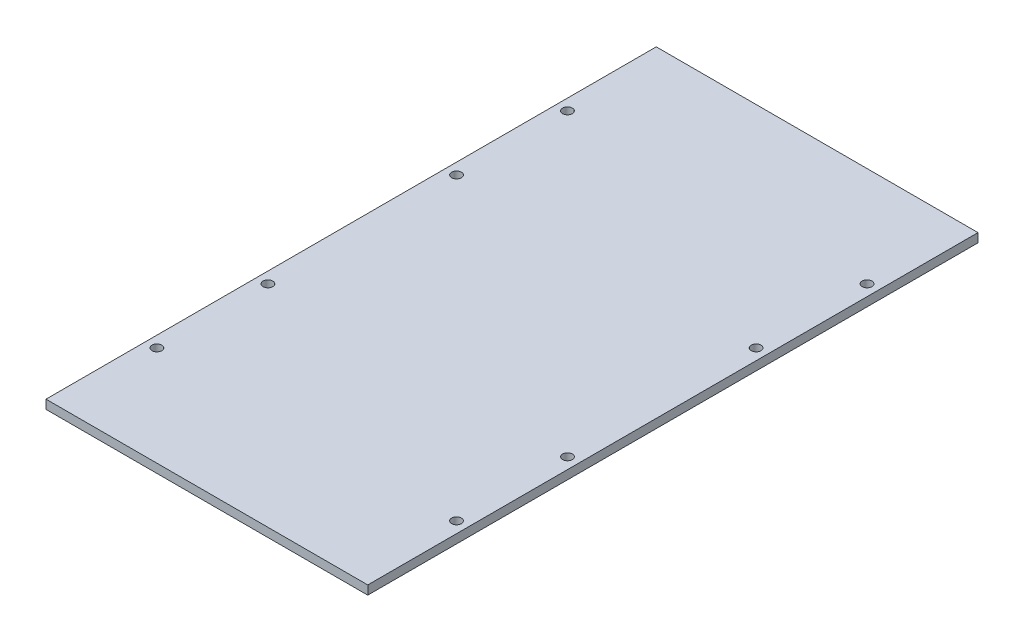
ISO-10303-21;
HEADER;
FILE_DESCRIPTION(('STEP AP214'),'2;1');
FILE_NAME('part.step','',(''),(''),'','','');
FILE_SCHEMA(('AUTOMOTIVE_DESIGN { 1 0 10303 214 1 1 1 1 }'));
ENDSEC;
DATA;
#1=APPLICATION_CONTEXT('core data for automotive mechanical design processes');
#2=APPLICATION_PROTOCOL_DEFINITION('international standard','automotive_design',2000,#1);
#3=PRODUCT_CONTEXT('',#1,'mechanical');
#4=PRODUCT('Part','Part','',(#3));
#5=PRODUCT_RELATED_PRODUCT_CATEGORY('part','',(#4));
#6=PRODUCT_DEFINITION_FORMATION('','',#4);
#7=PRODUCT_DEFINITION_CONTEXT('part definition',#1,'design');
#8=PRODUCT_DEFINITION('design','',#6,#7);
#9=PRODUCT_DEFINITION_SHAPE('','',#8);
#10=(LENGTH_UNIT() NAMED_UNIT(*) SI_UNIT(.MILLI.,.METRE.));
#11=(NAMED_UNIT(*) PLANE_ANGLE_UNIT() SI_UNIT($,.RADIAN.));
#12=(NAMED_UNIT(*) SI_UNIT($,.STERADIAN.) SOLID_ANGLE_UNIT());
#13=UNCERTAINTY_MEASURE_WITH_UNIT(LENGTH_MEASURE(1.E-05),#10,'distance_accuracy_value','');
#14=(GEOMETRIC_REPRESENTATION_CONTEXT(3) GLOBAL_UNCERTAINTY_ASSIGNED_CONTEXT((#13)) GLOBAL_UNIT_ASSIGNED_CONTEXT((#10,
#11,#12)) REPRESENTATION_CONTEXT('',''));
#15=CARTESIAN_POINT('',(0.,0.,0.));
#16=DIRECTION('',(0.,0.,1.));
#17=DIRECTION('',(1.,0.,0.));
#18=AXIS2_PLACEMENT_3D('',#15,#16,#17);
#19=CARTESIAN_POINT('',(-72.5000000000001,4.,137.5));
#20=DIRECTION('',(1.,0.,0.));
#21=DIRECTION('',(0.,0.,-1.));
#22=AXIS2_PLACEMENT_3D('',#19,#20,#21);
#23=PLANE('',#22);
#24=DIRECTION('',(0.,0.,1.));
#25=VECTOR('',#24,1.);
#26=CARTESIAN_POINT('',(-72.5000000000001,0.,137.5));
#27=LINE('',#26,#25);
#28=CARTESIAN_POINT('',(-72.5000000000001,0.,-137.5));
#29=VERTEX_POINT('',#28);
#30=CARTESIAN_POINT('',(-72.5000000000001,0.,137.5));
#31=VERTEX_POINT('',#30);
#32=EDGE_CURVE('E99',#29,#31,#27,.T.);
#33=ORIENTED_EDGE('',*,*,#32,.T.);
#34=DIRECTION('',(0.,-1.,0.));
#35=VECTOR('',#34,1.);
#36=CARTESIAN_POINT('',(-72.5000000000001,4.,137.5));
#37=LINE('',#36,#35);
#38=CARTESIAN_POINT('',(-72.5000000000001,4.,137.5));
#39=VERTEX_POINT('',#38);
#40=EDGE_CURVE('E11',#39,#31,#37,.T.);
#41=ORIENTED_EDGE('',*,*,#40,.F.);
#42=DIRECTION('',(0.,0.,1.));
#43=VECTOR('',#42,1.);
#44=CARTESIAN_POINT('',(-72.5000000000001,4.,137.5));
#45=LINE('',#44,#43);
#46=CARTESIAN_POINT('',(-72.5000000000001,4.,-137.5));
#47=VERTEX_POINT('',#46);
#48=EDGE_CURVE('E87',#47,#39,#45,.T.);
#49=ORIENTED_EDGE('',*,*,#48,.F.);
#50=DIRECTION('',(0.,-1.,0.));
#51=VECTOR('',#50,1.);
#52=CARTESIAN_POINT('',(-72.5000000000001,4.,-137.5));
#53=LINE('',#52,#51);
#54=EDGE_CURVE('E95',#47,#29,#53,.T.);
#55=ORIENTED_EDGE('',*,*,#54,.T.);
#56=EDGE_LOOP('',(#33,#41,#49,#55));
#57=FACE_BOUND('',#56,.T.);
#58=ADVANCED_FACE('F36',(#57),#23,.F.);
#59=CARTESIAN_POINT('',(72.5,4.,137.5));
#60=DIRECTION('',(0.,0.,-1.));
#61=DIRECTION('',(-1.,0.,0.));
#62=AXIS2_PLACEMENT_3D('',#59,#60,#61);
#63=PLANE('',#62);
#64=DIRECTION('',(1.,0.,0.));
#65=VECTOR('',#64,1.);
#66=CARTESIAN_POINT('',(72.5,0.,137.5));
#67=LINE('',#66,#65);
#68=CARTESIAN_POINT('',(72.5,0.,137.5));
#69=VERTEX_POINT('',#68);
#70=EDGE_CURVE('E91',#31,#69,#67,.T.);
#71=ORIENTED_EDGE('',*,*,#70,.T.);
#72=DIRECTION('',(0.,-1.,0.));
#73=VECTOR('',#72,1.);
#74=CARTESIAN_POINT('',(72.5,4.,137.5));
#75=LINE('',#74,#73);
#76=CARTESIAN_POINT('',(72.5,4.,137.5));
#77=VERTEX_POINT('',#76);
#78=EDGE_CURVE('E44',#77,#69,#75,.T.);
#79=ORIENTED_EDGE('',*,*,#78,.F.);
#80=DIRECTION('',(1.,0.,0.));
#81=VECTOR('',#80,1.);
#82=CARTESIAN_POINT('',(72.5,4.,137.5));
#83=LINE('',#82,#81);
#84=EDGE_CURVE('E82',#39,#77,#83,.T.);
#85=ORIENTED_EDGE('',*,*,#84,.F.);
#86=ORIENTED_EDGE('',*,*,#40,.T.);
#87=EDGE_LOOP('',(#71,#79,#85,#86));
#88=FACE_BOUND('',#87,.T.);
#89=ADVANCED_FACE('F90',(#88),#63,.F.);
#90=CARTESIAN_POINT('',(72.5,4.,137.5));
#91=DIRECTION('',(-1.,0.,0.));
#92=DIRECTION('',(0.,0.,1.));
#93=AXIS2_PLACEMENT_3D('',#90,#91,#92);
#94=PLANE('',#93);
#95=DIRECTION('',(0.,0.,-1.));
#96=VECTOR('',#95,1.);
#97=CARTESIAN_POINT('',(72.5,0.,137.5));
#98=LINE('',#97,#96);
#99=CARTESIAN_POINT('',(72.4999999999999,0.,-137.5));
#100=VERTEX_POINT('',#99);
#101=EDGE_CURVE('E69',#69,#100,#98,.T.);
#102=ORIENTED_EDGE('',*,*,#101,.T.);
#103=DIRECTION('',(0.,-1.,0.));
#104=VECTOR('',#103,1.);
#105=CARTESIAN_POINT('',(72.4999999999999,4.,-137.5));
#106=LINE('',#105,#104);
#107=CARTESIAN_POINT('',(72.4999999999999,4.,-137.5));
#108=VERTEX_POINT('',#107);
#109=EDGE_CURVE('E92',#108,#100,#106,.T.);
#110=ORIENTED_EDGE('',*,*,#109,.F.);
#111=DIRECTION('',(0.,0.,-1.));
#112=VECTOR('',#111,1.);
#113=CARTESIAN_POINT('',(72.5,4.,137.5));
#114=LINE('',#113,#112);
#115=EDGE_CURVE('E85',#77,#108,#114,.T.);
#116=ORIENTED_EDGE('',*,*,#115,.F.);
#117=ORIENTED_EDGE('',*,*,#78,.T.);
#118=EDGE_LOOP('',(#102,#110,#116,#117));
#119=FACE_BOUND('',#118,.T.);
#120=ADVANCED_FACE('F93',(#119),#94,.F.);
#121=CARTESIAN_POINT('',(72.4999999999999,4.,-137.5));
#122=DIRECTION('',(0.,0.,1.));
#123=DIRECTION('',(1.,0.,0.));
#124=AXIS2_PLACEMENT_3D('',#121,#122,#123);
#125=PLANE('',#124);
#126=DIRECTION('',(-1.,0.,0.));
#127=VECTOR('',#126,1.);
#128=CARTESIAN_POINT('',(72.4999999999999,0.,-137.5));
#129=LINE('',#128,#127);
#130=EDGE_CURVE('E75',#100,#29,#129,.T.);
#131=ORIENTED_EDGE('',*,*,#130,.T.);
#132=ORIENTED_EDGE('',*,*,#54,.F.);
#133=DIRECTION('',(-1.,0.,0.));
#134=VECTOR('',#133,1.);
#135=CARTESIAN_POINT('',(72.4999999999999,4.,-137.5));
#136=LINE('',#135,#134);
#137=EDGE_CURVE('E52',#108,#47,#136,.T.);
#138=ORIENTED_EDGE('',*,*,#137,.F.);
#139=ORIENTED_EDGE('',*,*,#109,.T.);
#140=EDGE_LOOP('',(#131,#132,#138,#139));
#141=FACE_BOUND('',#140,.T.);
#142=ADVANCED_FACE('F107',(#141),#125,.F.);
#143=CARTESIAN_POINT('',(0.,4.,0.));
#144=DIRECTION('',(0.,1.,0.));
#145=DIRECTION('',(0.,0.,1.));
#146=AXIS2_PLACEMENT_3D('',#143,#144,#145);
#147=PLANE('',#146);
#148=CARTESIAN_POINT('',(-67.5,4.,-42.5000000000001));
#149=DIRECTION('',(0.,1.,0.));
#150=DIRECTION('',(0.,0.,1.));
#151=AXIS2_PLACEMENT_3D('',#148,#149,#150);
#152=CIRCLE('',#151,2.2);
#153=CARTESIAN_POINT('',(-67.5,4.,-40.3000000000001));
#154=VERTEX_POINT('',#153);
#155=EDGE_CURVE('E138',#154,#154,#152,.T.);
#156=ORIENTED_EDGE('',*,*,#155,.F.);
#157=EDGE_LOOP('',(#156));
#158=FACE_BOUND('',#157,.T.);
#159=CARTESIAN_POINT('',(-67.5,4.,42.4999999999999));
#160=DIRECTION('',(0.,1.,0.));
#161=DIRECTION('',(0.,0.,1.));
#162=AXIS2_PLACEMENT_3D('',#159,#160,#161);
#163=CIRCLE('',#162,2.2);
#164=CARTESIAN_POINT('',(-67.5,4.,44.6999999999999));
#165=VERTEX_POINT('',#164);
#166=EDGE_CURVE('E132',#165,#165,#163,.T.);
#167=ORIENTED_EDGE('',*,*,#166,.F.);
#168=EDGE_LOOP('',(#167));
#169=FACE_BOUND('',#168,.T.);
#170=CARTESIAN_POINT('',(-67.5,4.,92.4999999999999));
#171=DIRECTION('',(0.,1.,0.));
#172=DIRECTION('',(0.,0.,1.));
#173=AXIS2_PLACEMENT_3D('',#170,#171,#172);
#174=CIRCLE('',#173,2.2);
#175=CARTESIAN_POINT('',(-67.5,4.,94.6999999999999));
#176=VERTEX_POINT('',#175);
#177=EDGE_CURVE('E126',#176,#176,#174,.T.);
#178=ORIENTED_EDGE('',*,*,#177,.F.);
#179=EDGE_LOOP('',(#178));
#180=FACE_BOUND('',#179,.T.);
#181=CARTESIAN_POINT('',(67.5,4.,92.4999999999999));
#182=DIRECTION('',(0.,1.,0.));
#183=DIRECTION('',(0.,0.,-1.));
#184=AXIS2_PLACEMENT_3D('',#181,#182,#183);
#185=CIRCLE('',#184,2.2);
#186=CARTESIAN_POINT('',(67.5,4.,90.3));
#187=VERTEX_POINT('',#186);
#188=EDGE_CURVE('E119',#187,#187,#185,.T.);
#189=ORIENTED_EDGE('',*,*,#188,.F.);
#190=EDGE_LOOP('',(#189));
#191=FACE_BOUND('',#190,.T.);
#192=CARTESIAN_POINT('',(67.5,4.,42.4999999999999));
#193=DIRECTION('',(0.,1.,0.));
#194=DIRECTION('',(0.,0.,-1.));
#195=AXIS2_PLACEMENT_3D('',#192,#193,#194);
#196=CIRCLE('',#195,2.2);
#197=CARTESIAN_POINT('',(67.5,4.,40.2999999999999));
#198=VERTEX_POINT('',#197);
#199=EDGE_CURVE('E155',#198,#198,#196,.T.);
#200=ORIENTED_EDGE('',*,*,#199,.F.);
#201=EDGE_LOOP('',(#200));
#202=FACE_BOUND('',#201,.T.);
#203=CARTESIAN_POINT('',(67.5,4.,-42.5000000000001));
#204=DIRECTION('',(0.,1.,0.));
#205=DIRECTION('',(0.,0.,-1.));
#206=AXIS2_PLACEMENT_3D('',#203,#204,#205);
#207=CIRCLE('',#206,2.2);
#208=CARTESIAN_POINT('',(67.5,4.,-44.7000000000001));
#209=VERTEX_POINT('',#208);
#210=EDGE_CURVE('E149',#209,#209,#207,.T.);
#211=ORIENTED_EDGE('',*,*,#210,.F.);
#212=EDGE_LOOP('',(#211));
#213=FACE_BOUND('',#212,.T.);
#214=CARTESIAN_POINT('',(67.5,4.,-92.5000000000001));
#215=DIRECTION('',(0.,1.,0.));
#216=DIRECTION('',(0.,0.,-1.));
#217=AXIS2_PLACEMENT_3D('',#214,#215,#216);
#218=CIRCLE('',#217,2.2);
#219=CARTESIAN_POINT('',(67.5,4.,-94.7000000000001));
#220=VERTEX_POINT('',#219);
#221=EDGE_CURVE('E143',#220,#220,#218,.T.);
#222=ORIENTED_EDGE('',*,*,#221,.F.);
#223=EDGE_LOOP('',(#222));
#224=FACE_BOUND('',#223,.T.);
#225=CARTESIAN_POINT('',(-67.5,4.,-92.5000000000001));
#226=DIRECTION('',(0.,1.,0.));
#227=DIRECTION('',(0.,0.,1.));
#228=AXIS2_PLACEMENT_3D('',#225,#226,#227);
#229=CIRCLE('',#228,2.2);
#230=CARTESIAN_POINT('',(-67.5,4.,-90.3000000000001));
#231=VERTEX_POINT('',#230);
#232=EDGE_CURVE('E113',#231,#231,#229,.T.);
#233=ORIENTED_EDGE('',*,*,#232,.F.);
#234=EDGE_LOOP('',(#233));
#235=FACE_BOUND('',#234,.T.);
#236=ORIENTED_EDGE('',*,*,#48,.T.);
#237=ORIENTED_EDGE('',*,*,#84,.T.);
#238=ORIENTED_EDGE('',*,*,#115,.T.);
#239=ORIENTED_EDGE('',*,*,#137,.T.);
#240=EDGE_LOOP('',(#236,#237,#238,#239));
#241=FACE_BOUND('',#240,.T.);
#242=ADVANCED_FACE('F83',(#158,#169,#180,#191,#202,#213,#224,#235,#241),#147,.T.);
#243=CARTESIAN_POINT('',(0.,0.,0.));
#244=DIRECTION('',(0.,1.,0.));
#245=DIRECTION('',(0.,0.,1.));
#246=AXIS2_PLACEMENT_3D('',#243,#244,#245);
#247=PLANE('',#246);
#248=CARTESIAN_POINT('',(-67.5,0.,-42.5000000000001));
#249=DIRECTION('',(0.,1.,0.));
#250=DIRECTION('',(0.,0.,1.));
#251=AXIS2_PLACEMENT_3D('',#248,#249,#250);
#252=CIRCLE('',#251,2.2);
#253=CARTESIAN_POINT('',(-67.5,0.,-40.3000000000001));
#254=VERTEX_POINT('',#253);
#255=EDGE_CURVE('E116',#254,#254,#252,.T.);
#256=ORIENTED_EDGE('',*,*,#255,.T.);
#257=EDGE_LOOP('',(#256));
#258=FACE_BOUND('',#257,.T.);
#259=CARTESIAN_POINT('',(-67.5,0.,42.4999999999999));
#260=DIRECTION('',(0.,1.,0.));
#261=DIRECTION('',(0.,0.,1.));
#262=AXIS2_PLACEMENT_3D('',#259,#260,#261);
#263=CIRCLE('',#262,2.2);
#264=CARTESIAN_POINT('',(-67.5,0.,44.6999999999999));
#265=VERTEX_POINT('',#264);
#266=EDGE_CURVE('E135',#265,#265,#263,.T.);
#267=ORIENTED_EDGE('',*,*,#266,.T.);
#268=EDGE_LOOP('',(#267));
#269=FACE_BOUND('',#268,.T.);
#270=CARTESIAN_POINT('',(-67.5,0.,92.4999999999999));
#271=DIRECTION('',(0.,1.,0.));
#272=DIRECTION('',(0.,0.,1.));
#273=AXIS2_PLACEMENT_3D('',#270,#271,#272);
#274=CIRCLE('',#273,2.2);
#275=CARTESIAN_POINT('',(-67.5,0.,94.6999999999999));
#276=VERTEX_POINT('',#275);
#277=EDGE_CURVE('E129',#276,#276,#274,.T.);
#278=ORIENTED_EDGE('',*,*,#277,.T.);
#279=EDGE_LOOP('',(#278));
#280=FACE_BOUND('',#279,.T.);
#281=CARTESIAN_POINT('',(67.5,0.,92.4999999999999));
#282=DIRECTION('',(0.,1.,0.));
#283=DIRECTION('',(0.,0.,-1.));
#284=AXIS2_PLACEMENT_3D('',#281,#282,#283);
#285=CIRCLE('',#284,2.2);
#286=CARTESIAN_POINT('',(67.5,0.,90.3));
#287=VERTEX_POINT('',#286);
#288=EDGE_CURVE('E122',#287,#287,#285,.T.);
#289=ORIENTED_EDGE('',*,*,#288,.T.);
#290=EDGE_LOOP('',(#289));
#291=FACE_BOUND('',#290,.T.);
#292=CARTESIAN_POINT('',(67.5,0.,42.4999999999999));
#293=DIRECTION('',(0.,1.,0.));
#294=DIRECTION('',(0.,0.,-1.));
#295=AXIS2_PLACEMENT_3D('',#292,#293,#294);
#296=CIRCLE('',#295,2.2);
#297=CARTESIAN_POINT('',(67.5,0.,40.2999999999999));
#298=VERTEX_POINT('',#297);
#299=EDGE_CURVE('E123',#298,#298,#296,.T.);
#300=ORIENTED_EDGE('',*,*,#299,.T.);
#301=EDGE_LOOP('',(#300));
#302=FACE_BOUND('',#301,.T.);
#303=CARTESIAN_POINT('',(67.5,0.,-42.5000000000001));
#304=DIRECTION('',(0.,1.,0.));
#305=DIRECTION('',(0.,0.,-1.));
#306=AXIS2_PLACEMENT_3D('',#303,#304,#305);
#307=CIRCLE('',#306,2.2);
#308=CARTESIAN_POINT('',(67.5,0.,-44.7000000000001));
#309=VERTEX_POINT('',#308);
#310=EDGE_CURVE('E152',#309,#309,#307,.T.);
#311=ORIENTED_EDGE('',*,*,#310,.T.);
#312=EDGE_LOOP('',(#311));
#313=FACE_BOUND('',#312,.T.);
#314=CARTESIAN_POINT('',(67.5,0.,-92.5000000000001));
#315=DIRECTION('',(0.,1.,0.));
#316=DIRECTION('',(0.,0.,-1.));
#317=AXIS2_PLACEMENT_3D('',#314,#315,#316);
#318=CIRCLE('',#317,2.2);
#319=CARTESIAN_POINT('',(67.5,0.,-94.7000000000001));
#320=VERTEX_POINT('',#319);
#321=EDGE_CURVE('E146',#320,#320,#318,.T.);
#322=ORIENTED_EDGE('',*,*,#321,.T.);
#323=EDGE_LOOP('',(#322));
#324=FACE_BOUND('',#323,.T.);
#325=CARTESIAN_POINT('',(-67.5,0.,-92.5000000000001));
#326=DIRECTION('',(0.,1.,0.));
#327=DIRECTION('',(0.,0.,1.));
#328=AXIS2_PLACEMENT_3D('',#325,#326,#327);
#329=CIRCLE('',#328,2.2);
#330=CARTESIAN_POINT('',(-67.5,0.,-90.3000000000001));
#331=VERTEX_POINT('',#330);
#332=EDGE_CURVE('E102',#331,#331,#329,.T.);
#333=ORIENTED_EDGE('',*,*,#332,.T.);
#334=EDGE_LOOP('',(#333));
#335=FACE_BOUND('',#334,.T.);
#336=ORIENTED_EDGE('',*,*,#32,.F.);
#337=ORIENTED_EDGE('',*,*,#130,.F.);
#338=ORIENTED_EDGE('',*,*,#101,.F.);
#339=ORIENTED_EDGE('',*,*,#70,.F.);
#340=EDGE_LOOP('',(#336,#337,#338,#339));
#341=FACE_BOUND('',#340,.T.);
#342=ADVANCED_FACE('F110',(#258,#269,#280,#291,#302,#313,#324,#335,#341),#247,.F.);
#343=CARTESIAN_POINT('',(-67.5,0.,-92.5000000000001));
#344=DIRECTION('',(0.,1.,0.));
#345=DIRECTION('',(0.,0.,1.));
#346=AXIS2_PLACEMENT_3D('',#343,#344,#345);
#347=CYLINDRICAL_SURFACE('',#346,2.2);
#348=ORIENTED_EDGE('',*,*,#332,.F.);
#349=EDGE_LOOP('',(#348));
#350=FACE_BOUND('',#349,.T.);
#351=ORIENTED_EDGE('',*,*,#232,.T.);
#352=EDGE_LOOP('',(#351));
#353=FACE_BOUND('',#352,.T.);
#354=ADVANCED_FACE('F181',(#350,#353),#347,.F.);
#355=CARTESIAN_POINT('',(67.5,0.,-92.5000000000001));
#356=DIRECTION('',(0.,1.,0.));
#357=DIRECTION('',(0.,0.,1.));
#358=AXIS2_PLACEMENT_3D('',#355,#356,#357);
#359=CYLINDRICAL_SURFACE('',#358,2.2);
#360=ORIENTED_EDGE('',*,*,#321,.F.);
#361=EDGE_LOOP('',(#360));
#362=FACE_BOUND('',#361,.T.);
#363=ORIENTED_EDGE('',*,*,#221,.T.);
#364=EDGE_LOOP('',(#363));
#365=FACE_BOUND('',#364,.T.);
#366=ADVANCED_FACE('F183',(#362,#365),#359,.F.);
#367=CARTESIAN_POINT('',(67.5,0.,-42.5000000000001));
#368=DIRECTION('',(0.,1.,0.));
#369=DIRECTION('',(0.,0.,1.));
#370=AXIS2_PLACEMENT_3D('',#367,#368,#369);
#371=CYLINDRICAL_SURFACE('',#370,2.2);
#372=ORIENTED_EDGE('',*,*,#310,.F.);
#373=EDGE_LOOP('',(#372));
#374=FACE_BOUND('',#373,.T.);
#375=ORIENTED_EDGE('',*,*,#210,.T.);
#376=EDGE_LOOP('',(#375));
#377=FACE_BOUND('',#376,.T.);
#378=ADVANCED_FACE('F167',(#374,#377),#371,.F.);
#379=CARTESIAN_POINT('',(67.5,0.,42.4999999999999));
#380=DIRECTION('',(0.,1.,0.));
#381=DIRECTION('',(0.,0.,1.));
#382=AXIS2_PLACEMENT_3D('',#379,#380,#381);
#383=CYLINDRICAL_SURFACE('',#382,2.2);
#384=ORIENTED_EDGE('',*,*,#299,.F.);
#385=EDGE_LOOP('',(#384));
#386=FACE_BOUND('',#385,.T.);
#387=ORIENTED_EDGE('',*,*,#199,.T.);
#388=EDGE_LOOP('',(#387));
#389=FACE_BOUND('',#388,.T.);
#390=ADVANCED_FACE('F163',(#386,#389),#383,.F.);
#391=CARTESIAN_POINT('',(67.5,0.,92.4999999999999));
#392=DIRECTION('',(0.,1.,0.));
#393=DIRECTION('',(0.,0.,1.));
#394=AXIS2_PLACEMENT_3D('',#391,#392,#393);
#395=CYLINDRICAL_SURFACE('',#394,2.2);
#396=ORIENTED_EDGE('',*,*,#288,.F.);
#397=EDGE_LOOP('',(#396));
#398=FACE_BOUND('',#397,.T.);
#399=ORIENTED_EDGE('',*,*,#188,.T.);
#400=EDGE_LOOP('',(#399));
#401=FACE_BOUND('',#400,.T.);
#402=ADVANCED_FACE('F166',(#398,#401),#395,.F.);
#403=CARTESIAN_POINT('',(-67.5,0.,92.4999999999999));
#404=DIRECTION('',(0.,1.,0.));
#405=DIRECTION('',(0.,0.,1.));
#406=AXIS2_PLACEMENT_3D('',#403,#404,#405);
#407=CYLINDRICAL_SURFACE('',#406,2.2);
#408=ORIENTED_EDGE('',*,*,#277,.F.);
#409=EDGE_LOOP('',(#408));
#410=FACE_BOUND('',#409,.T.);
#411=ORIENTED_EDGE('',*,*,#177,.T.);
#412=EDGE_LOOP('',(#411));
#413=FACE_BOUND('',#412,.T.);
#414=ADVANCED_FACE('F252',(#410,#413),#407,.F.);
#415=CARTESIAN_POINT('',(-67.5,0.,42.4999999999999));
#416=DIRECTION('',(0.,1.,0.));
#417=DIRECTION('',(0.,0.,1.));
#418=AXIS2_PLACEMENT_3D('',#415,#416,#417);
#419=CYLINDRICAL_SURFACE('',#418,2.2);
#420=ORIENTED_EDGE('',*,*,#266,.F.);
#421=EDGE_LOOP('',(#420));
#422=FACE_BOUND('',#421,.T.);
#423=ORIENTED_EDGE('',*,*,#166,.T.);
#424=EDGE_LOOP('',(#423));
#425=FACE_BOUND('',#424,.T.);
#426=ADVANCED_FACE('F261',(#422,#425),#419,.F.);
#427=CARTESIAN_POINT('',(-67.5,0.,-42.5000000000001));
#428=DIRECTION('',(0.,1.,0.));
#429=DIRECTION('',(0.,0.,1.));
#430=AXIS2_PLACEMENT_3D('',#427,#428,#429);
#431=CYLINDRICAL_SURFACE('',#430,2.2);
#432=ORIENTED_EDGE('',*,*,#255,.F.);
#433=EDGE_LOOP('',(#432));
#434=FACE_BOUND('',#433,.T.);
#435=ORIENTED_EDGE('',*,*,#155,.T.);
#436=EDGE_LOOP('',(#435));
#437=FACE_BOUND('',#436,.T.);
#438=ADVANCED_FACE('F271',(#434,#437),#431,.F.);
#439=CLOSED_SHELL('',(#58,#89,#120,#142,#242,#342,#354,#366,#378,#390,#402,#414,#426,#438));
#440=MANIFOLD_SOLID_BREP('B2',#439);
#441=ADVANCED_BREP_SHAPE_REPRESENTATION('',(#18,#440),#14);
#442=SHAPE_DEFINITION_REPRESENTATION(#9,#441);
ENDSEC;
END-ISO-10303-21;
